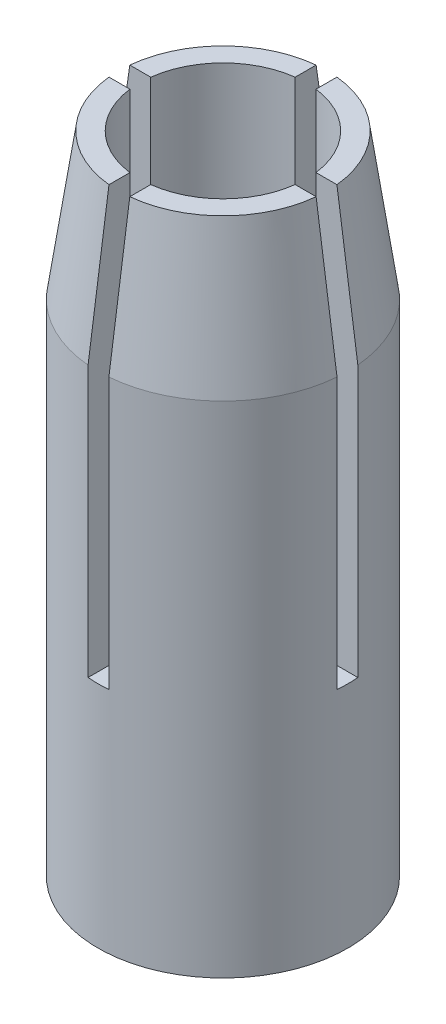
ISO-10303-21;
HEADER;
FILE_DESCRIPTION(('STEP AP214'),'2;1');
FILE_NAME('part.step','',(''),(''),'','','');
FILE_SCHEMA(('AUTOMOTIVE_DESIGN { 1 0 10303 214 1 1 1 1 }'));
ENDSEC;
DATA;
#1=APPLICATION_CONTEXT('core data for automotive mechanical design processes');
#2=APPLICATION_PROTOCOL_DEFINITION('international standard','automotive_design',2000,#1);
#3=PRODUCT_CONTEXT('',#1,'mechanical');
#4=PRODUCT('Part','Part','',(#3));
#5=PRODUCT_RELATED_PRODUCT_CATEGORY('part','',(#4));
#6=PRODUCT_DEFINITION_FORMATION('','',#4);
#7=PRODUCT_DEFINITION_CONTEXT('part definition',#1,'design');
#8=PRODUCT_DEFINITION('design','',#6,#7);
#9=PRODUCT_DEFINITION_SHAPE('','',#8);
#10=(LENGTH_UNIT() NAMED_UNIT(*) SI_UNIT(.MILLI.,.METRE.));
#11=(NAMED_UNIT(*) PLANE_ANGLE_UNIT() SI_UNIT($,.RADIAN.));
#12=(NAMED_UNIT(*) SI_UNIT($,.STERADIAN.) SOLID_ANGLE_UNIT());
#13=UNCERTAINTY_MEASURE_WITH_UNIT(LENGTH_MEASURE(1.E-05),#10,'distance_accuracy_value','');
#14=(GEOMETRIC_REPRESENTATION_CONTEXT(3) GLOBAL_UNCERTAINTY_ASSIGNED_CONTEXT((#13)) GLOBAL_UNIT_ASSIGNED_CONTEXT((#10,
#11,#12)) REPRESENTATION_CONTEXT('',''));
#15=CARTESIAN_POINT('',(0.,0.,0.));
#16=DIRECTION('',(0.,0.,1.));
#17=DIRECTION('',(1.,0.,0.));
#18=AXIS2_PLACEMENT_3D('',#15,#16,#17);
#19=CARTESIAN_POINT('',(0.,5.5,0.));
#20=DIRECTION('',(0.,1.,0.));
#21=DIRECTION('',(0.,0.,1.));
#22=AXIS2_PLACEMENT_3D('',#19,#20,#21);
#23=PLANE('',#22);
#24=CARTESIAN_POINT('',(0.,5.5,0.));
#25=DIRECTION('',(0.,1.,0.));
#26=DIRECTION('',(0.,0.,1.));
#27=AXIS2_PLACEMENT_3D('',#24,#25,#26);
#28=CIRCLE('',#27,2.);
#29=CARTESIAN_POINT('',(1.98431348329844,5.5,0.25));
#30=VERTEX_POINT('',#29);
#31=CARTESIAN_POINT('',(1.98431348329844,5.5,-0.249999999999999));
#32=VERTEX_POINT('',#31);
#33=EDGE_CURVE('E11',#30,#32,#28,.T.);
#34=ORIENTED_EDGE('',*,*,#33,.F.);
#35=DIRECTION('',(1.,0.,0.));
#36=VECTOR('',#35,1.);
#37=CARTESIAN_POINT('',(6.25,5.5,0.25));
#38=LINE('',#37,#36);
#39=CARTESIAN_POINT('',(2.98956518577535,5.5,0.25));
#40=VERTEX_POINT('',#39);
#41=EDGE_CURVE('E329',#30,#40,#38,.T.);
#42=ORIENTED_EDGE('',*,*,#41,.T.);
#43=CARTESIAN_POINT('',(0.,5.5,0.));
#44=DIRECTION('',(0.,1.,0.));
#45=DIRECTION('',(0.,0.,1.));
#46=AXIS2_PLACEMENT_3D('',#43,#44,#45);
#47=CIRCLE('',#46,3.);
#48=CARTESIAN_POINT('',(2.98956518577535,5.5,-0.249999999999999));
#49=VERTEX_POINT('',#48);
#50=EDGE_CURVE('E281',#49,#40,#47,.F.);
#51=ORIENTED_EDGE('',*,*,#50,.F.);
#52=DIRECTION('',(-1.,0.,0.));
#53=VECTOR('',#52,1.);
#54=CARTESIAN_POINT('',(0.25,5.5,-0.25));
#55=LINE('',#54,#53);
#56=EDGE_CURVE('E207',#49,#32,#55,.T.);
#57=ORIENTED_EDGE('',*,*,#56,.T.);
#58=EDGE_LOOP('',(#34,#42,#51,#57));
#59=FACE_BOUND('',#58,.T.);
#60=ADVANCED_FACE('F37',(#59),#23,.T.);
#61=CARTESIAN_POINT('',(0.25,5.5,-1.98431348329844));
#62=VERTEX_POINT('',#61);
#63=CARTESIAN_POINT('',(-0.249999999999999,5.5,-1.98431348329844));
#64=VERTEX_POINT('',#63);
#65=EDGE_CURVE('E46',#62,#64,#28,.T.);
#66=ORIENTED_EDGE('',*,*,#65,.F.);
#67=DIRECTION('',(0.,0.,-1.));
#68=VECTOR('',#67,1.);
#69=CARTESIAN_POINT('',(0.25,5.5,-6.25));
#70=LINE('',#69,#68);
#71=CARTESIAN_POINT('',(0.25,5.5,-2.98956518577535));
#72=VERTEX_POINT('',#71);
#73=EDGE_CURVE('E192',#62,#72,#70,.T.);
#74=ORIENTED_EDGE('',*,*,#73,.T.);
#75=CARTESIAN_POINT('',(-0.249999999999999,5.5,-2.98956518577535));
#76=VERTEX_POINT('',#75);
#77=EDGE_CURVE('E290',#76,#72,#47,.F.);
#78=ORIENTED_EDGE('',*,*,#77,.F.);
#79=DIRECTION('',(0.,0.,1.));
#80=VECTOR('',#79,1.);
#81=CARTESIAN_POINT('',(-0.249999999999999,5.5,-0.25));
#82=LINE('',#81,#80);
#83=EDGE_CURVE('E311',#76,#64,#82,.T.);
#84=ORIENTED_EDGE('',*,*,#83,.T.);
#85=EDGE_LOOP('',(#66,#74,#78,#84));
#86=FACE_BOUND('',#85,.T.);
#87=ADVANCED_FACE('F316',(#86),#23,.T.);
#88=CARTESIAN_POINT('',(-1.98431348329844,5.5,-0.249999999999999));
#89=VERTEX_POINT('',#88);
#90=CARTESIAN_POINT('',(-1.98431348329844,5.5,0.25));
#91=VERTEX_POINT('',#90);
#92=EDGE_CURVE('E302',#89,#91,#28,.T.);
#93=ORIENTED_EDGE('',*,*,#92,.F.);
#94=DIRECTION('',(-1.,0.,0.));
#95=VECTOR('',#94,1.);
#96=CARTESIAN_POINT('',(-6.25,5.5,-0.249999999999999));
#97=LINE('',#96,#95);
#98=CARTESIAN_POINT('',(-2.98956518577535,5.5,-0.249999999999999));
#99=VERTEX_POINT('',#98);
#100=EDGE_CURVE('E318',#89,#99,#97,.T.);
#101=ORIENTED_EDGE('',*,*,#100,.T.);
#102=CARTESIAN_POINT('',(-2.98956518577535,5.5,0.250000000000001));
#103=VERTEX_POINT('',#102);
#104=EDGE_CURVE('E280',#103,#99,#47,.F.);
#105=ORIENTED_EDGE('',*,*,#104,.F.);
#106=DIRECTION('',(1.,0.,0.));
#107=VECTOR('',#106,1.);
#108=CARTESIAN_POINT('',(-0.249999999999999,5.5,0.25));
#109=LINE('',#108,#107);
#110=EDGE_CURVE('E320',#103,#91,#109,.T.);
#111=ORIENTED_EDGE('',*,*,#110,.T.);
#112=EDGE_LOOP('',(#93,#101,#105,#111));
#113=FACE_BOUND('',#112,.T.);
#114=ADVANCED_FACE('F431',(#113),#23,.T.);
#115=CARTESIAN_POINT('',(0.,15.5,0.));
#116=DIRECTION('',(0.,1.,0.));
#117=DIRECTION('',(0.,0.,1.));
#118=AXIS2_PLACEMENT_3D('',#115,#116,#117);
#119=PLANE('',#118);
#120=CARTESIAN_POINT('',(0.,15.5,0.));
#121=DIRECTION('',(0.,-1.,0.));
#122=DIRECTION('',(0.,0.,-1.));
#123=AXIS2_PLACEMENT_3D('',#120,#121,#122);
#124=CIRCLE('',#123,2.);
#125=CARTESIAN_POINT('',(0.25,15.5,-1.98431348329844));
#126=VERTEX_POINT('',#125);
#127=CARTESIAN_POINT('',(1.98431348329844,15.5,-0.249999999999999));
#128=VERTEX_POINT('',#127);
#129=EDGE_CURVE('E172',#126,#128,#124,.T.);
#130=ORIENTED_EDGE('',*,*,#129,.T.);
#131=DIRECTION('',(-1.,0.,0.));
#132=VECTOR('',#131,1.);
#133=CARTESIAN_POINT('',(0.25,15.5,-0.25));
#134=LINE('',#133,#132);
#135=CARTESIAN_POINT('',(2.48746859276655,15.5,-0.249999999999999));
#136=VERTEX_POINT('',#135);
#137=EDGE_CURVE('E221',#136,#128,#134,.T.);
#138=ORIENTED_EDGE('',*,*,#137,.F.);
#139=CARTESIAN_POINT('',(0.,15.5,0.));
#140=DIRECTION('',(0.,-1.,0.));
#141=DIRECTION('',(0.,0.,-1.));
#142=AXIS2_PLACEMENT_3D('',#139,#140,#141);
#143=CIRCLE('',#142,2.5);
#144=CARTESIAN_POINT('',(0.25,15.5,-2.48746859276655));
#145=VERTEX_POINT('',#144);
#146=EDGE_CURVE('E199',#145,#136,#143,.T.);
#147=ORIENTED_EDGE('',*,*,#146,.F.);
#148=DIRECTION('',(0.,0.,-1.));
#149=VECTOR('',#148,1.);
#150=CARTESIAN_POINT('',(0.25,15.5,-6.25));
#151=LINE('',#150,#149);
#152=EDGE_CURVE('E189',#126,#145,#151,.T.);
#153=ORIENTED_EDGE('',*,*,#152,.F.);
#154=EDGE_LOOP('',(#130,#138,#147,#153));
#155=FACE_BOUND('',#154,.T.);
#156=ADVANCED_FACE('F197',(#155),#119,.T.);
#157=CARTESIAN_POINT('',(1.98431348329844,15.5,0.25));
#158=VERTEX_POINT('',#157);
#159=CARTESIAN_POINT('',(0.25,15.5,1.98431348329844));
#160=VERTEX_POINT('',#159);
#161=EDGE_CURVE('E183',#158,#160,#124,.T.);
#162=ORIENTED_EDGE('',*,*,#161,.T.);
#163=DIRECTION('',(0.,0.,-1.));
#164=VECTOR('',#163,1.);
#165=CARTESIAN_POINT('',(0.25,15.5,0.25));
#166=LINE('',#165,#164);
#167=CARTESIAN_POINT('',(0.25,15.5,2.48746859276655));
#168=VERTEX_POINT('',#167);
#169=EDGE_CURVE('E216',#168,#160,#166,.T.);
#170=ORIENTED_EDGE('',*,*,#169,.F.);
#171=CARTESIAN_POINT('',(2.48746859276655,15.5,0.25));
#172=VERTEX_POINT('',#171);
#173=EDGE_CURVE('E276',#172,#168,#143,.T.);
#174=ORIENTED_EDGE('',*,*,#173,.F.);
#175=DIRECTION('',(1.,0.,0.));
#176=VECTOR('',#175,1.);
#177=CARTESIAN_POINT('',(6.25,15.5,0.25));
#178=LINE('',#177,#176);
#179=EDGE_CURVE('E219',#158,#172,#178,.T.);
#180=ORIENTED_EDGE('',*,*,#179,.F.);
#181=EDGE_LOOP('',(#162,#170,#174,#180));
#182=FACE_BOUND('',#181,.T.);
#183=ADVANCED_FACE('F415',(#182),#119,.T.);
#184=CARTESIAN_POINT('',(-0.249999999999999,15.5,1.98431348329844));
#185=VERTEX_POINT('',#184);
#186=CARTESIAN_POINT('',(-1.98431348329844,15.5,0.25));
#187=VERTEX_POINT('',#186);
#188=EDGE_CURVE('E418',#185,#187,#124,.T.);
#189=ORIENTED_EDGE('',*,*,#188,.T.);
#190=DIRECTION('',(1.,0.,0.));
#191=VECTOR('',#190,1.);
#192=CARTESIAN_POINT('',(-0.249999999999999,15.5,0.25));
#193=LINE('',#192,#191);
#194=CARTESIAN_POINT('',(-2.48746859276655,15.5,0.250000000000001));
#195=VERTEX_POINT('',#194);
#196=EDGE_CURVE('E211',#195,#187,#193,.T.);
#197=ORIENTED_EDGE('',*,*,#196,.F.);
#198=CARTESIAN_POINT('',(-0.249999999999999,15.5,2.48746859276655));
#199=VERTEX_POINT('',#198);
#200=EDGE_CURVE('E433',#199,#195,#143,.T.);
#201=ORIENTED_EDGE('',*,*,#200,.F.);
#202=DIRECTION('',(0.,0.,1.));
#203=VECTOR('',#202,1.);
#204=CARTESIAN_POINT('',(-0.249999999999999,15.5,6.25));
#205=LINE('',#204,#203);
#206=EDGE_CURVE('E214',#185,#199,#205,.T.);
#207=ORIENTED_EDGE('',*,*,#206,.F.);
#208=EDGE_LOOP('',(#189,#197,#201,#207));
#209=FACE_BOUND('',#208,.T.);
#210=ADVANCED_FACE('F441',(#209),#119,.T.);
#211=CARTESIAN_POINT('',(0.,12.,0.));
#212=DIRECTION('',(0.,-1.,0.));
#213=DIRECTION('',(0.,0.,-1.));
#214=AXIS2_PLACEMENT_3D('',#211,#212,#213);
#215=CONICAL_SURFACE('',#214,3.,0.141897054604164);
#216=CARTESIAN_POINT('',(0.25,17.5974181034012,-2.18612054619095));
#217=CARTESIAN_POINT('',(0.25,16.3253345447487,-2.36900749170544));
#218=CARTESIAN_POINT('',(0.25,15.0532172360124,-2.55165936364087));
#219=CARTESIAN_POINT('',(0.25,13.3620493745075,-2.79426649400318));
#220=CARTESIAN_POINT('',(0.25,12.9430188500199,-2.85436134005573));
#221=CARTESIAN_POINT('',(0.25,10.8328004035789,-3.15692332874558));
#222=CARTESIAN_POINT('',(0.25,9.14158138153774,-3.39917363737321));
#223=CARTESIAN_POINT('',(0.25,7.45035573658055,-3.64137735206729));
#224=B_SPLINE_CURVE_WITH_KNOTS('',3,(#216,#217,#218,#219,#220,#221,#222,#223),.UNSPECIFIED.,.F.,
.F.,(4,2,2,4),(0.,3.85548924063714,5.12544267930526,10.2508852950475),.UNSPECIFIED.);
#225=CARTESIAN_POINT('',(0.25,12.,-2.98956518577535));
#226=VERTEX_POINT('',#225);
#227=EDGE_CURVE('E253',#145,#226,#224,.T.);
#228=ORIENTED_EDGE('',*,*,#227,.F.);
#229=ORIENTED_EDGE('',*,*,#146,.T.);
#230=CARTESIAN_POINT('',(3.64137735206729,7.45035573658055,-0.249999999999999));
#231=CARTESIAN_POINT('',(3.52028937255365,8.29597056504085,-0.249999999999999));
#232=CARTESIAN_POINT('',(3.39917658861142,9.14158184315956,-0.249999999999999));
#233=CARTESIAN_POINT('',(3.1568739578554,10.8327933417464,-0.249999999999999));
#234=CARTESIAN_POINT('',(3.03568411104306,11.6783935622148,-0.249999999999999));
#235=CARTESIAN_POINT('',(2.79319989441477,13.3695790312572,-0.249999999999999));
#236=CARTESIAN_POINT('',(2.67190552459748,14.215164279831,-0.249999999999999));
#237=CARTESIAN_POINT('',(2.4291518444079,15.9063111155802,-0.249999999999999));
#238=CARTESIAN_POINT('',(2.3076925340324,16.7518727027551,-0.249999999999999));
#239=CARTESIAN_POINT('',(2.18612054619095,17.5974181034012,-0.249999999999999));
#240=B_SPLINE_CURVE_WITH_KNOTS('',3,(#230,#231,#232,#233,#234,#235,#236,#237,#238,#239),
.UNSPECIFIED.,.F.,.F.,(4,2,2,2,4),(0.,2.56272133473702,5.12544262106358,7.6881639400474,
10.2508853089314),.UNSPECIFIED.);
#241=CARTESIAN_POINT('',(2.98956518577535,12.,-0.249999999999999));
#242=VERTEX_POINT('',#241);
#243=EDGE_CURVE('E260',#242,#136,#240,.T.);
#244=ORIENTED_EDGE('',*,*,#243,.F.);
#245=CARTESIAN_POINT('',(0.,12.,0.));
#246=DIRECTION('',(0.,-1.,0.));
#247=DIRECTION('',(0.,0.,-1.));
#248=AXIS2_PLACEMENT_3D('',#245,#246,#247);
#249=CIRCLE('',#248,3.);
#250=EDGE_CURVE('E269',#226,#242,#249,.T.);
#251=ORIENTED_EDGE('',*,*,#250,.F.);
#252=EDGE_LOOP('',(#228,#229,#244,#251));
#253=FACE_BOUND('',#252,.T.);
#254=ADVANCED_FACE('F346',(#253),#215,.T.);
#255=CARTESIAN_POINT('',(2.18612054619095,17.5974181034012,0.25));
#256=CARTESIAN_POINT('',(2.36900749170544,16.3253345447487,0.25));
#257=CARTESIAN_POINT('',(2.55165936364087,15.0532172360124,0.25));
#258=CARTESIAN_POINT('',(2.79426649400318,13.3620493745075,0.25));
#259=CARTESIAN_POINT('',(2.85436134005573,12.9430188500199,0.25));
#260=CARTESIAN_POINT('',(3.15692332874558,10.8328004035789,0.25));
#261=CARTESIAN_POINT('',(3.39917363737321,9.14158138153774,0.25));
#262=CARTESIAN_POINT('',(3.64137735206729,7.45035573658055,0.25));
#263=B_SPLINE_CURVE_WITH_KNOTS('',3,(#255,#256,#257,#258,#259,#260,#261,#262),.UNSPECIFIED.,.F.,
.F.,(4,2,2,4),(0.,3.85548924063714,5.12544267930526,10.2508852950475),.UNSPECIFIED.);
#264=CARTESIAN_POINT('',(2.98956518577535,12.,0.25));
#265=VERTEX_POINT('',#264);
#266=EDGE_CURVE('E347',#172,#265,#263,.T.);
#267=ORIENTED_EDGE('',*,*,#266,.F.);
#268=ORIENTED_EDGE('',*,*,#173,.T.);
#269=CARTESIAN_POINT('',(0.25,7.45035573658055,3.64137735206729));
#270=CARTESIAN_POINT('',(0.25,8.29597056504085,3.52028937255365));
#271=CARTESIAN_POINT('',(0.25,9.14158184315956,3.39917658861142));
#272=CARTESIAN_POINT('',(0.25,10.8327933417464,3.1568739578554));
#273=CARTESIAN_POINT('',(0.25,11.6783935622148,3.03568411104306));
#274=CARTESIAN_POINT('',(0.25,13.3695790312572,2.79319989441477));
#275=CARTESIAN_POINT('',(0.25,14.215164279831,2.67190552459748));
#276=CARTESIAN_POINT('',(0.25,15.9063111155802,2.4291518444079));
#277=CARTESIAN_POINT('',(0.25,16.7518727027551,2.3076925340324));
#278=CARTESIAN_POINT('',(0.25,17.5974181034012,2.18612054619095));
#279=B_SPLINE_CURVE_WITH_KNOTS('',3,(#269,#270,#271,#272,#273,#274,#275,#276,#277,#278),
.UNSPECIFIED.,.F.,.F.,(4,2,2,2,4),(0.,2.56272133473702,5.12544262106358,7.6881639400474,
10.2508853089314),.UNSPECIFIED.);
#280=CARTESIAN_POINT('',(0.25,12.,2.98956518577535));
#281=VERTEX_POINT('',#280);
#282=EDGE_CURVE('E348',#281,#168,#279,.T.);
#283=ORIENTED_EDGE('',*,*,#282,.F.);
#284=EDGE_CURVE('E273',#265,#281,#249,.T.);
#285=ORIENTED_EDGE('',*,*,#284,.F.);
#286=EDGE_LOOP('',(#267,#268,#283,#285));
#287=FACE_BOUND('',#286,.T.);
#288=ADVANCED_FACE('F408',(#287),#215,.T.);
#289=CARTESIAN_POINT('',(-0.249999999999999,17.5974181034012,2.18612054619095));
#290=CARTESIAN_POINT('',(-0.249999999999999,16.3253345447487,2.36900749170544));
#291=CARTESIAN_POINT('',(-0.249999999999999,15.0532172360124,2.55165936364087));
#292=CARTESIAN_POINT('',(-0.249999999999999,13.3620493745075,2.79426649400318));
#293=CARTESIAN_POINT('',(-0.249999999999999,12.9430188500199,2.85436134005573));
#294=CARTESIAN_POINT('',(-0.249999999999999,10.8328004035789,3.15692332874558));
#295=CARTESIAN_POINT('',(-0.249999999999999,9.14158138153774,3.39917363737321));
#296=CARTESIAN_POINT('',(-0.249999999999999,7.45035573658055,3.64137735206729));
#297=B_SPLINE_CURVE_WITH_KNOTS('',3,(#289,#290,#291,#292,#293,#294,#295,#296),.UNSPECIFIED.,.F.,
.F.,(4,2,2,4),(0.,3.85548924063714,5.12544267930526,10.2508852950475),.UNSPECIFIED.);
#298=CARTESIAN_POINT('',(-0.249999999999999,12.,2.98956518577535));
#299=VERTEX_POINT('',#298);
#300=EDGE_CURVE('E351',#199,#299,#297,.T.);
#301=ORIENTED_EDGE('',*,*,#300,.F.);
#302=ORIENTED_EDGE('',*,*,#200,.T.);
#303=CARTESIAN_POINT('',(-3.64137735206729,7.45035573658055,0.250000000000001));
#304=CARTESIAN_POINT('',(-3.52028937255365,8.29597056504085,0.250000000000001));
#305=CARTESIAN_POINT('',(-3.39917658861142,9.14158184315956,0.250000000000001));
#306=CARTESIAN_POINT('',(-3.1568739578554,10.8327933417464,0.250000000000001));
#307=CARTESIAN_POINT('',(-3.03568411104306,11.6783935622148,0.250000000000001));
#308=CARTESIAN_POINT('',(-2.79319989441477,13.3695790312572,0.250000000000001));
#309=CARTESIAN_POINT('',(-2.67190552459748,14.215164279831,0.250000000000001));
#310=CARTESIAN_POINT('',(-2.4291518444079,15.9063111155802,0.250000000000001));
#311=CARTESIAN_POINT('',(-2.3076925340324,16.7518727027551,0.250000000000001));
#312=CARTESIAN_POINT('',(-2.18612054619095,17.5974181034012,0.25));
#313=B_SPLINE_CURVE_WITH_KNOTS('',3,(#303,#304,#305,#306,#307,#308,#309,#310,#311,#312),
.UNSPECIFIED.,.F.,.F.,(4,2,2,2,4),(0.,2.56272133473702,5.12544262106358,7.6881639400474,
10.2508853089314),.UNSPECIFIED.);
#314=CARTESIAN_POINT('',(-2.98956518577535,12.,0.250000000000001));
#315=VERTEX_POINT('',#314);
#316=EDGE_CURVE('E381',#315,#195,#313,.T.);
#317=ORIENTED_EDGE('',*,*,#316,.F.);
#318=EDGE_CURVE('E399',#299,#315,#249,.T.);
#319=ORIENTED_EDGE('',*,*,#318,.F.);
#320=EDGE_LOOP('',(#301,#302,#317,#319));
#321=FACE_BOUND('',#320,.T.);
#322=ADVANCED_FACE('F438',(#321),#215,.T.);
#323=CARTESIAN_POINT('',(-1.98431348329844,15.5,-0.249999999999999));
#324=VERTEX_POINT('',#323);
#325=CARTESIAN_POINT('',(-0.249999999999999,15.5,-1.98431348329844));
#326=VERTEX_POINT('',#325);
#327=EDGE_CURVE('E185',#324,#326,#124,.T.);
#328=ORIENTED_EDGE('',*,*,#327,.T.);
#329=DIRECTION('',(0.,0.,1.));
#330=VECTOR('',#329,1.);
#331=CARTESIAN_POINT('',(-0.249999999999999,15.5,-0.25));
#332=LINE('',#331,#330);
#333=CARTESIAN_POINT('',(-0.249999999999999,15.5,-2.48746859276655));
#334=VERTEX_POINT('',#333);
#335=EDGE_CURVE('E200',#334,#326,#332,.T.);
#336=ORIENTED_EDGE('',*,*,#335,.F.);
#337=CARTESIAN_POINT('',(-2.48746859276655,15.5,-0.249999999999999));
#338=VERTEX_POINT('',#337);
#339=EDGE_CURVE('E272',#338,#334,#143,.T.);
#340=ORIENTED_EDGE('',*,*,#339,.F.);
#341=DIRECTION('',(-1.,0.,0.));
#342=VECTOR('',#341,1.);
#343=CARTESIAN_POINT('',(-6.25,15.5,-0.249999999999999));
#344=LINE('',#343,#342);
#345=EDGE_CURVE('E203',#324,#338,#344,.T.);
#346=ORIENTED_EDGE('',*,*,#345,.F.);
#347=EDGE_LOOP('',(#328,#336,#340,#346));
#348=FACE_BOUND('',#347,.T.);
#349=ADVANCED_FACE('F39',(#348),#119,.T.);
#350=CARTESIAN_POINT('',(-2.18612054619095,17.5974181034012,-0.249999999999999));
#351=CARTESIAN_POINT('',(-2.36900749170544,16.3253345447487,-0.249999999999999));
#352=CARTESIAN_POINT('',(-2.55165936364087,15.0532172360124,-0.249999999999999));
#353=CARTESIAN_POINT('',(-2.79426649400318,13.3620493745075,-0.249999999999999));
#354=CARTESIAN_POINT('',(-2.85436134005573,12.9430188500199,-0.249999999999999));
#355=CARTESIAN_POINT('',(-3.15692332874558,10.8328004035789,-0.249999999999999));
#356=CARTESIAN_POINT('',(-3.39917363737321,9.14158138153774,-0.249999999999999));
#357=CARTESIAN_POINT('',(-3.64137735206729,7.45035573658055,-0.249999999999999));
#358=B_SPLINE_CURVE_WITH_KNOTS('',3,(#350,#351,#352,#353,#354,#355,#356,#357),.UNSPECIFIED.,.F.,
.F.,(4,2,2,4),(0.,3.85548924063714,5.12544267930526,10.2508852950475),.UNSPECIFIED.);
#359=CARTESIAN_POINT('',(-2.98956518577535,12.,-0.249999999999999));
#360=VERTEX_POINT('',#359);
#361=EDGE_CURVE('E229',#338,#360,#358,.T.);
#362=ORIENTED_EDGE('',*,*,#361,.F.);
#363=ORIENTED_EDGE('',*,*,#339,.T.);
#364=CARTESIAN_POINT('',(-0.249999999999999,7.45035573658055,-3.64137735206729));
#365=CARTESIAN_POINT('',(-0.249999999999999,8.29597056504085,-3.52028937255365));
#366=CARTESIAN_POINT('',(-0.249999999999999,9.14158184315956,-3.39917658861142));
#367=CARTESIAN_POINT('',(-0.249999999999999,10.8327933417464,-3.1568739578554));
#368=CARTESIAN_POINT('',(-0.249999999999999,11.6783935622148,-3.03568411104306));
#369=CARTESIAN_POINT('',(-0.249999999999999,13.3695790312572,-2.79319989441477));
#370=CARTESIAN_POINT('',(-0.249999999999999,14.215164279831,-2.67190552459748));
#371=CARTESIAN_POINT('',(-0.249999999999999,15.9063111155802,-2.4291518444079));
#372=CARTESIAN_POINT('',(-0.249999999999999,16.7518727027551,-2.3076925340324));
#373=CARTESIAN_POINT('',(-0.249999999999999,17.5974181034012,-2.18612054619095));
#374=B_SPLINE_CURVE_WITH_KNOTS('',3,(#364,#365,#366,#367,#368,#369,#370,#371,#372,#373),
.UNSPECIFIED.,.F.,.F.,(4,2,2,2,4),(0.,2.56272133473702,5.12544262106358,7.6881639400474,
10.2508853089314),.UNSPECIFIED.);
#375=CARTESIAN_POINT('',(-0.249999999999999,12.,-2.98956518577535));
#376=VERTEX_POINT('',#375);
#377=EDGE_CURVE('E223',#376,#334,#374,.T.);
#378=ORIENTED_EDGE('',*,*,#377,.F.);
#379=EDGE_CURVE('E268',#360,#376,#249,.T.);
#380=ORIENTED_EDGE('',*,*,#379,.F.);
#381=EDGE_LOOP('',(#362,#363,#378,#380));
#382=FACE_BOUND('',#381,.T.);
#383=ADVANCED_FACE('F235',(#382),#215,.T.);
#384=CARTESIAN_POINT('',(0.,0.,0.));
#385=DIRECTION('',(0.,-1.,0.));
#386=DIRECTION('',(0.,0.,-1.));
#387=AXIS2_PLACEMENT_3D('',#384,#385,#386);
#388=CYLINDRICAL_SURFACE('',#387,3.);
#389=DIRECTION('',(0.,-1.,0.));
#390=VECTOR('',#389,1.);
#391=CARTESIAN_POINT('',(-2.98956518577535,0.,0.250000000000001));
#392=LINE('',#391,#390);
#393=EDGE_CURVE('E297',#103,#315,#392,.F.);
#394=ORIENTED_EDGE('',*,*,#393,.F.);
#395=ORIENTED_EDGE('',*,*,#104,.T.);
#396=DIRECTION('',(0.,-1.,0.));
#397=VECTOR('',#396,1.);
#398=CARTESIAN_POINT('',(-2.98956518577535,0.,-0.249999999999999));
#399=LINE('',#398,#397);
#400=EDGE_CURVE('E295',#360,#99,#399,.T.);
#401=ORIENTED_EDGE('',*,*,#400,.F.);
#402=ORIENTED_EDGE('',*,*,#379,.T.);
#403=DIRECTION('',(0.,-1.,0.));
#404=VECTOR('',#403,1.);
#405=CARTESIAN_POINT('',(-0.249999999999999,0.,-2.98956518577535));
#406=LINE('',#405,#404);
#407=EDGE_CURVE('E291',#76,#376,#406,.F.);
#408=ORIENTED_EDGE('',*,*,#407,.F.);
#409=ORIENTED_EDGE('',*,*,#77,.T.);
#410=DIRECTION('',(0.,-1.,0.));
#411=VECTOR('',#410,1.);
#412=CARTESIAN_POINT('',(0.25,0.,-2.98956518577535));
#413=LINE('',#412,#411);
#414=EDGE_CURVE('E293',#226,#72,#413,.T.);
#415=ORIENTED_EDGE('',*,*,#414,.F.);
#416=ORIENTED_EDGE('',*,*,#250,.T.);
#417=DIRECTION('',(0.,-1.,0.));
#418=VECTOR('',#417,1.);
#419=CARTESIAN_POINT('',(2.98956518577535,0.,-0.249999999999999));
#420=LINE('',#419,#418);
#421=EDGE_CURVE('E288',#49,#242,#420,.F.);
#422=ORIENTED_EDGE('',*,*,#421,.F.);
#423=ORIENTED_EDGE('',*,*,#50,.T.);
#424=DIRECTION('',(0.,-1.,0.));
#425=VECTOR('',#424,1.);
#426=CARTESIAN_POINT('',(2.98956518577535,0.,0.25));
#427=LINE('',#426,#425);
#428=EDGE_CURVE('E285',#265,#40,#427,.T.);
#429=ORIENTED_EDGE('',*,*,#428,.F.);
#430=ORIENTED_EDGE('',*,*,#284,.T.);
#431=DIRECTION('',(0.,-1.,0.));
#432=VECTOR('',#431,1.);
#433=CARTESIAN_POINT('',(0.25,0.,2.98956518577535));
#434=LINE('',#433,#432);
#435=CARTESIAN_POINT('',(0.25,5.5,2.98956518577535));
#436=VERTEX_POINT('',#435);
#437=EDGE_CURVE('E283',#436,#281,#434,.F.);
#438=ORIENTED_EDGE('',*,*,#437,.F.);
#439=CARTESIAN_POINT('',(-0.249999999999999,5.5,2.98956518577535));
#440=VERTEX_POINT('',#439);
#441=EDGE_CURVE('E275',#436,#440,#47,.F.);
#442=ORIENTED_EDGE('',*,*,#441,.T.);
#443=DIRECTION('',(0.,-1.,0.));
#444=VECTOR('',#443,1.);
#445=CARTESIAN_POINT('',(-0.249999999999999,0.,2.98956518577535));
#446=LINE('',#445,#444);
#447=EDGE_CURVE('E279',#299,#440,#446,.T.);
#448=ORIENTED_EDGE('',*,*,#447,.F.);
#449=ORIENTED_EDGE('',*,*,#318,.T.);
#450=EDGE_LOOP('',(#394,#395,#401,#402,#408,#409,#415,#416,#422,#423,#429,#430,#438,#442,#448,#449));
#451=FACE_BOUND('',#450,.T.);
#452=CARTESIAN_POINT('',(0.,0.,0.));
#453=DIRECTION('',(0.,-1.,0.));
#454=DIRECTION('',(0.,0.,-1.));
#455=AXIS2_PLACEMENT_3D('',#452,#453,#454);
#456=CIRCLE('',#455,3.);
#457=CARTESIAN_POINT('',(0.,0.,-3.));
#458=VERTEX_POINT('',#457);
#459=EDGE_CURVE('E259',#458,#458,#456,.T.);
#460=ORIENTED_EDGE('',*,*,#459,.F.);
#461=EDGE_LOOP('',(#460));
#462=FACE_BOUND('',#461,.T.);
#463=ADVANCED_FACE('F340',(#451,#462),#388,.T.);
#464=CARTESIAN_POINT('',(3.,0.,0.));
#465=DIRECTION('',(0.,-1.,0.));
#466=DIRECTION('',(0.,0.,-1.));
#467=AXIS2_PLACEMENT_3D('',#464,#465,#466);
#468=PLANE('',#467);
#469=CARTESIAN_POINT('',(0.,0.,0.));
#470=DIRECTION('',(0.,-1.,0.));
#471=DIRECTION('',(0.,0.,-1.));
#472=AXIS2_PLACEMENT_3D('',#469,#470,#471);
#473=CIRCLE('',#472,2.);
#474=CARTESIAN_POINT('',(0.,0.,-2.));
#475=VERTEX_POINT('',#474);
#476=EDGE_CURVE('E421',#475,#475,#473,.T.);
#477=ORIENTED_EDGE('',*,*,#476,.F.);
#478=EDGE_LOOP('',(#477));
#479=FACE_BOUND('',#478,.T.);
#480=ORIENTED_EDGE('',*,*,#459,.T.);
#481=EDGE_LOOP('',(#480));
#482=FACE_BOUND('',#481,.T.);
#483=ADVANCED_FACE('F251',(#479,#482),#468,.T.);
#484=CARTESIAN_POINT('',(0.25,5.5,-6.25));
#485=DIRECTION('',(1.,0.,0.));
#486=DIRECTION('',(0.,0.,-1.));
#487=AXIS2_PLACEMENT_3D('',#484,#485,#486);
#488=PLANE('',#487);
#489=ORIENTED_EDGE('',*,*,#73,.F.);
#490=DIRECTION('',(0.,-1.,0.));
#491=VECTOR('',#490,1.);
#492=CARTESIAN_POINT('',(0.25,15.5,-1.98431348329844));
#493=LINE('',#492,#491);
#494=EDGE_CURVE('E175',#62,#126,#493,.F.);
#495=ORIENTED_EDGE('',*,*,#494,.T.);
#496=ORIENTED_EDGE('',*,*,#152,.T.);
#497=ORIENTED_EDGE('',*,*,#227,.T.);
#498=ORIENTED_EDGE('',*,*,#414,.T.);
#499=EDGE_LOOP('',(#489,#495,#496,#497,#498));
#500=FACE_BOUND('',#499,.T.);
#501=ADVANCED_FACE('F188',(#500),#488,.F.);
#502=CARTESIAN_POINT('',(0.25,5.5,-0.25));
#503=DIRECTION('',(0.,0.,-1.));
#504=DIRECTION('',(-1.,0.,0.));
#505=AXIS2_PLACEMENT_3D('',#502,#503,#504);
#506=PLANE('',#505);
#507=ORIENTED_EDGE('',*,*,#137,.T.);
#508=DIRECTION('',(0.,-1.,0.));
#509=VECTOR('',#508,1.);
#510=CARTESIAN_POINT('',(1.98431348329844,15.5,-0.249999999999999));
#511=LINE('',#510,#509);
#512=EDGE_CURVE('E178',#128,#32,#511,.T.);
#513=ORIENTED_EDGE('',*,*,#512,.T.);
#514=ORIENTED_EDGE('',*,*,#56,.F.);
#515=ORIENTED_EDGE('',*,*,#421,.T.);
#516=ORIENTED_EDGE('',*,*,#243,.T.);
#517=EDGE_LOOP('',(#507,#513,#514,#515,#516));
#518=FACE_BOUND('',#517,.T.);
#519=ADVANCED_FACE('F250',(#518),#506,.F.);
#520=CARTESIAN_POINT('',(6.25,5.5,0.25));
#521=DIRECTION('',(0.,0.,1.));
#522=DIRECTION('',(1.,0.,0.));
#523=AXIS2_PLACEMENT_3D('',#520,#521,#522);
#524=PLANE('',#523);
#525=ORIENTED_EDGE('',*,*,#41,.F.);
#526=DIRECTION('',(0.,-1.,0.));
#527=VECTOR('',#526,1.);
#528=CARTESIAN_POINT('',(1.98431348329844,15.5,0.25));
#529=LINE('',#528,#527);
#530=EDGE_CURVE('E193',#30,#158,#529,.F.);
#531=ORIENTED_EDGE('',*,*,#530,.T.);
#532=ORIENTED_EDGE('',*,*,#179,.T.);
#533=ORIENTED_EDGE('',*,*,#266,.T.);
#534=ORIENTED_EDGE('',*,*,#428,.T.);
#535=EDGE_LOOP('',(#525,#531,#532,#533,#534));
#536=FACE_BOUND('',#535,.T.);
#537=ADVANCED_FACE('F362',(#536),#524,.F.);
#538=CARTESIAN_POINT('',(0.25,5.5,0.25));
#539=DIRECTION('',(1.,0.,0.));
#540=DIRECTION('',(0.,0.,-1.));
#541=AXIS2_PLACEMENT_3D('',#538,#539,#540);
#542=PLANE('',#541);
#543=ORIENTED_EDGE('',*,*,#169,.T.);
#544=DIRECTION('',(0.,-1.,0.));
#545=VECTOR('',#544,1.);
#546=CARTESIAN_POINT('',(0.25,15.5,1.98431348329844));
#547=LINE('',#546,#545);
#548=CARTESIAN_POINT('',(0.25,5.5,1.98431348329844));
#549=VERTEX_POINT('',#548);
#550=EDGE_CURVE('E425',#160,#549,#547,.T.);
#551=ORIENTED_EDGE('',*,*,#550,.T.);
#552=DIRECTION('',(0.,0.,-1.));
#553=VECTOR('',#552,1.);
#554=CARTESIAN_POINT('',(0.25,5.5,0.25));
#555=LINE('',#554,#553);
#556=EDGE_CURVE('E327',#436,#549,#555,.T.);
#557=ORIENTED_EDGE('',*,*,#556,.F.);
#558=ORIENTED_EDGE('',*,*,#437,.T.);
#559=ORIENTED_EDGE('',*,*,#282,.T.);
#560=EDGE_LOOP('',(#543,#551,#557,#558,#559));
#561=FACE_BOUND('',#560,.T.);
#562=ADVANCED_FACE('F365',(#561),#542,.F.);
#563=CARTESIAN_POINT('',(-0.249999999999999,5.5,6.25));
#564=DIRECTION('',(-1.,0.,0.));
#565=DIRECTION('',(0.,0.,1.));
#566=AXIS2_PLACEMENT_3D('',#563,#564,#565);
#567=PLANE('',#566);
#568=DIRECTION('',(0.,0.,1.));
#569=VECTOR('',#568,1.);
#570=CARTESIAN_POINT('',(-0.249999999999999,5.5,6.25));
#571=LINE('',#570,#569);
#572=CARTESIAN_POINT('',(-0.249999999999999,5.5,1.98431348329844));
#573=VERTEX_POINT('',#572);
#574=EDGE_CURVE('E60',#573,#440,#571,.T.);
#575=ORIENTED_EDGE('',*,*,#574,.F.);
#576=DIRECTION('',(0.,-1.,0.));
#577=VECTOR('',#576,1.);
#578=CARTESIAN_POINT('',(-0.249999999999999,15.5,1.98431348329844));
#579=LINE('',#578,#577);
#580=EDGE_CURVE('E53',#573,#185,#579,.F.);
#581=ORIENTED_EDGE('',*,*,#580,.T.);
#582=ORIENTED_EDGE('',*,*,#206,.T.);
#583=ORIENTED_EDGE('',*,*,#300,.T.);
#584=ORIENTED_EDGE('',*,*,#447,.T.);
#585=EDGE_LOOP('',(#575,#581,#582,#583,#584));
#586=FACE_BOUND('',#585,.T.);
#587=ADVANCED_FACE('F371',(#586),#567,.F.);
#588=CARTESIAN_POINT('',(-0.249999999999999,5.5,0.25));
#589=DIRECTION('',(0.,0.,1.));
#590=DIRECTION('',(1.,0.,0.));
#591=AXIS2_PLACEMENT_3D('',#588,#589,#590);
#592=PLANE('',#591);
#593=ORIENTED_EDGE('',*,*,#196,.T.);
#594=DIRECTION('',(0.,-1.,0.));
#595=VECTOR('',#594,1.);
#596=CARTESIAN_POINT('',(-1.98431348329844,15.5,0.25));
#597=LINE('',#596,#595);
#598=EDGE_CURVE('E314',#187,#91,#597,.T.);
#599=ORIENTED_EDGE('',*,*,#598,.T.);
#600=ORIENTED_EDGE('',*,*,#110,.F.);
#601=ORIENTED_EDGE('',*,*,#393,.T.);
#602=ORIENTED_EDGE('',*,*,#316,.T.);
#603=EDGE_LOOP('',(#593,#599,#600,#601,#602));
#604=FACE_BOUND('',#603,.T.);
#605=ADVANCED_FACE('F375',(#604),#592,.F.);
#606=CARTESIAN_POINT('',(-6.25,5.5,-0.249999999999999));
#607=DIRECTION('',(0.,0.,-1.));
#608=DIRECTION('',(-1.,0.,0.));
#609=AXIS2_PLACEMENT_3D('',#606,#607,#608);
#610=PLANE('',#609);
#611=ORIENTED_EDGE('',*,*,#100,.F.);
#612=DIRECTION('',(0.,-1.,0.));
#613=VECTOR('',#612,1.);
#614=CARTESIAN_POINT('',(-1.98431348329844,15.5,-0.249999999999999));
#615=LINE('',#614,#613);
#616=EDGE_CURVE('E427',#89,#324,#615,.F.);
#617=ORIENTED_EDGE('',*,*,#616,.T.);
#618=ORIENTED_EDGE('',*,*,#345,.T.);
#619=ORIENTED_EDGE('',*,*,#361,.T.);
#620=ORIENTED_EDGE('',*,*,#400,.T.);
#621=EDGE_LOOP('',(#611,#617,#618,#619,#620));
#622=FACE_BOUND('',#621,.T.);
#623=ADVANCED_FACE('F243',(#622),#610,.F.);
#624=CARTESIAN_POINT('',(-0.249999999999999,5.5,-0.25));
#625=DIRECTION('',(-1.,0.,0.));
#626=DIRECTION('',(0.,0.,1.));
#627=AXIS2_PLACEMENT_3D('',#624,#625,#626);
#628=PLANE('',#627);
#629=ORIENTED_EDGE('',*,*,#335,.T.);
#630=DIRECTION('',(0.,-1.,0.));
#631=VECTOR('',#630,1.);
#632=CARTESIAN_POINT('',(-0.249999999999999,15.5,-1.98431348329844));
#633=LINE('',#632,#631);
#634=EDGE_CURVE('E194',#326,#64,#633,.T.);
#635=ORIENTED_EDGE('',*,*,#634,.T.);
#636=ORIENTED_EDGE('',*,*,#83,.F.);
#637=ORIENTED_EDGE('',*,*,#407,.T.);
#638=ORIENTED_EDGE('',*,*,#377,.T.);
#639=EDGE_LOOP('',(#629,#635,#636,#637,#638));
#640=FACE_BOUND('',#639,.T.);
#641=ADVANCED_FACE('F238',(#640),#628,.F.);
#642=EDGE_CURVE('E41',#573,#549,#28,.T.);
#643=ORIENTED_EDGE('',*,*,#642,.F.);
#644=ORIENTED_EDGE('',*,*,#574,.T.);
#645=ORIENTED_EDGE('',*,*,#441,.F.);
#646=ORIENTED_EDGE('',*,*,#556,.T.);
#647=EDGE_LOOP('',(#643,#644,#645,#646));
#648=FACE_BOUND('',#647,.T.);
#649=ADVANCED_FACE('F242',(#648),#23,.T.);
#650=CARTESIAN_POINT('',(0.,15.5,0.));
#651=DIRECTION('',(0.,-1.,0.));
#652=DIRECTION('',(0.,0.,-1.));
#653=AXIS2_PLACEMENT_3D('',#650,#651,#652);
#654=CYLINDRICAL_SURFACE('',#653,2.);
#655=ORIENTED_EDGE('',*,*,#476,.T.);
#656=EDGE_LOOP('',(#655));
#657=FACE_BOUND('',#656,.T.);
#658=ORIENTED_EDGE('',*,*,#129,.F.);
#659=ORIENTED_EDGE('',*,*,#494,.F.);
#660=ORIENTED_EDGE('',*,*,#65,.T.);
#661=ORIENTED_EDGE('',*,*,#634,.F.);
#662=ORIENTED_EDGE('',*,*,#327,.F.);
#663=ORIENTED_EDGE('',*,*,#616,.F.);
#664=ORIENTED_EDGE('',*,*,#92,.T.);
#665=ORIENTED_EDGE('',*,*,#598,.F.);
#666=ORIENTED_EDGE('',*,*,#188,.F.);
#667=ORIENTED_EDGE('',*,*,#580,.F.);
#668=ORIENTED_EDGE('',*,*,#642,.T.);
#669=ORIENTED_EDGE('',*,*,#550,.F.);
#670=ORIENTED_EDGE('',*,*,#161,.F.);
#671=ORIENTED_EDGE('',*,*,#530,.F.);
#672=ORIENTED_EDGE('',*,*,#33,.T.);
#673=ORIENTED_EDGE('',*,*,#512,.F.);
#674=EDGE_LOOP('',(#658,#659,#660,#661,#662,#663,#664,#665,#666,#667,#668,#669,#670,#671,#672,#673));
#675=FACE_BOUND('',#674,.T.);
#676=ADVANCED_FACE('F174',(#657,#675),#654,.F.);
#677=CLOSED_SHELL('',(#60,#87,#114,#156,#183,#210,#254,#288,#322,#349,#383,#463,#483,#501,#519,
#537,#562,#587,#605,#623,#641,#649,#676));
#678=MANIFOLD_SOLID_BREP('B2',#677);
#679=ADVANCED_BREP_SHAPE_REPRESENTATION('',(#18,#678),#14);
#680=SHAPE_DEFINITION_REPRESENTATION(#9,#679);
ENDSEC;
END-ISO-10303-21;
